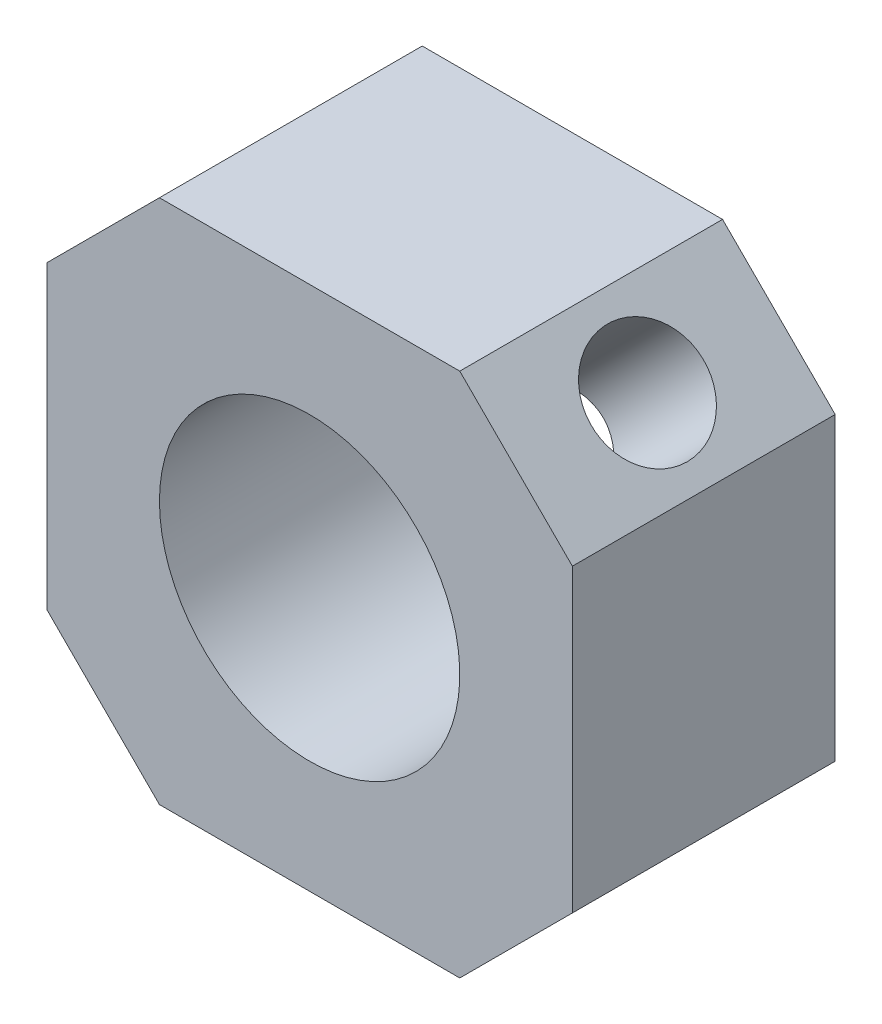
ISO-10303-21;
HEADER;
FILE_DESCRIPTION(('STEP AP214'),'2;1');
FILE_NAME('part.step','',(''),(''),'','','');
FILE_SCHEMA(('AUTOMOTIVE_DESIGN { 1 0 10303 214 1 1 1 1 }'));
ENDSEC;
DATA;
#1=APPLICATION_CONTEXT('core data for automotive mechanical design processes');
#2=APPLICATION_PROTOCOL_DEFINITION('international standard','automotive_design',2000,#1);
#3=PRODUCT_CONTEXT('',#1,'mechanical');
#4=PRODUCT('Part','Part','',(#3));
#5=PRODUCT_RELATED_PRODUCT_CATEGORY('part','',(#4));
#6=PRODUCT_DEFINITION_FORMATION('','',#4);
#7=PRODUCT_DEFINITION_CONTEXT('part definition',#1,'design');
#8=PRODUCT_DEFINITION('design','',#6,#7);
#9=PRODUCT_DEFINITION_SHAPE('','',#8);
#10=(LENGTH_UNIT() NAMED_UNIT(*) SI_UNIT(.MILLI.,.METRE.));
#11=(NAMED_UNIT(*) PLANE_ANGLE_UNIT() SI_UNIT($,.RADIAN.));
#12=(NAMED_UNIT(*) SI_UNIT($,.STERADIAN.) SOLID_ANGLE_UNIT());
#13=UNCERTAINTY_MEASURE_WITH_UNIT(LENGTH_MEASURE(1.E-05),#10,'distance_accuracy_value','');
#14=(GEOMETRIC_REPRESENTATION_CONTEXT(3) GLOBAL_UNCERTAINTY_ASSIGNED_CONTEXT((#13)) GLOBAL_UNIT_ASSIGNED_CONTEXT((#10,
#11,#12)) REPRESENTATION_CONTEXT('',''));
#15=CARTESIAN_POINT('',(0.,0.,0.));
#16=DIRECTION('',(0.,0.,1.));
#17=DIRECTION('',(1.,0.,0.));
#18=AXIS2_PLACEMENT_3D('',#15,#16,#17);
#19=CARTESIAN_POINT('',(5.578427125,5.578427125,-26.5));
#20=DIRECTION('',(-0.707106781186548,-0.707106781186548,0.));
#21=DIRECTION('',(0.707106781186548,-0.707106781186548,0.));
#22=AXIS2_PLACEMENT_3D('',#19,#20,#21);
#23=CYLINDRICAL_SURFACE('',#22,1.5);
#24=CARTESIAN_POINT('',(2.82842712237061,2.82842712237061,-28.));
#25=CARTESIAN_POINT('',(2.8858167510829,2.77103390829815,-27.9999967391737));
#26=CARTESIAN_POINT('',(2.94147140690556,2.71185431610224,-27.9933849725625));
#27=CARTESIAN_POINT('',(3.04775879295592,2.59183511030959,-27.9671921570462));
#28=CARTESIAN_POINT('',(3.09838741896399,2.5309941909401,-27.9476006075002));
#29=CARTESIAN_POINT('',(3.193472520482,2.40990637586566,-27.8962443985259));
#30=CARTESIAN_POINT('',(3.2379430145436,2.34965843098492,-27.8645080276378));
#31=CARTESIAN_POINT('',(3.32035897981574,2.23168142159578,-27.789886507077));
#32=CARTESIAN_POINT('',(3.35830379177576,2.17395261201963,-27.7470002320943));
#33=CARTESIAN_POINT('',(3.42890800250299,2.06087471249284,-27.6493879050116));
#34=CARTESIAN_POINT('',(3.46130879421228,2.00570187521155,-27.5942707615584));
#35=CARTESIAN_POINT('',(3.51916141549955,1.90237124953126,-27.474590779996));
#36=CARTESIAN_POINT('',(3.54461098918778,1.85421574083654,-27.4100248858842));
#37=CARTESIAN_POINT('',(3.58970301333526,1.76539300986052,-27.270282580811));
#38=CARTESIAN_POINT('',(3.6090874169981,1.72508078192346,-27.1947957420072));
#39=CARTESIAN_POINT('',(3.64102365960012,1.65661838685408,-27.0371517656455));
#40=CARTESIAN_POINT('',(3.65357821808974,1.62846337980608,-26.9549972980428));
#41=CARTESIAN_POINT('',(3.67174277929914,1.58707275190751,-26.7898832459272));
#42=CARTESIAN_POINT('',(3.67761653071947,1.57327249589394,-26.7070949337251));
#43=CARTESIAN_POINT('',(3.68344379858428,1.55958414241461,-26.5401838137721));
#44=CARTESIAN_POINT('',(3.68339976200063,1.55969029472724,-26.4560615719806));
#45=CARTESIAN_POINT('',(3.67757710355411,1.57336265127034,-26.2942306040685));
#46=CARTESIAN_POINT('',(3.6721418447921,1.58612291361214,-26.2164393507037));
#47=CARTESIAN_POINT('',(3.65594789858781,1.62309827210491,-26.0642130955572));
#48=CARTESIAN_POINT('',(3.64518839194722,1.64731513096311,-25.9897786121776));
#49=CARTESIAN_POINT('',(3.61790765642888,1.70640456732384,-25.8447212570608));
#50=CARTESIAN_POINT('',(3.60128115414046,1.74147028803811,-25.7741972861848));
#51=CARTESIAN_POINT('',(3.56205133162023,1.82036457474259,-25.6400513340722));
#52=CARTESIAN_POINT('',(3.5394462203318,1.86419576570913,-25.5764314292068));
#53=CARTESIAN_POINT('',(3.48625168968779,1.96197478270727,-25.453406123959));
#54=CARTESIAN_POINT('',(3.45522845918882,2.01640395340795,-25.3945695517068));
#55=CARTESIAN_POINT('',(3.38580095625726,2.13092246581182,-25.2876767763049));
#56=CARTESIAN_POINT('',(3.34739328980197,2.19101440372648,-25.2396255523964));
#57=CARTESIAN_POINT('',(3.26255032282609,2.31549718417046,-25.1550359414123));
#58=CARTESIAN_POINT('',(3.21599562697787,2.37994169954501,-25.1186955703888));
#59=CARTESIAN_POINT('',(3.1158581746412,2.50960096639428,-25.0599803795133));
#60=CARTESIAN_POINT('',(3.06228990890183,2.57481388415266,-25.0375772981992));
#61=CARTESIAN_POINT('',(2.97758897144,2.67129465820976,-25.0150813367619));
#62=CARTESIAN_POINT('',(2.94861065906056,2.7032518076581,-25.0094340760901));
#63=CARTESIAN_POINT('',(2.88940417240811,2.76644495908647,-25.0018921542245));
#64=CARTESIAN_POINT('',(2.85917600031453,2.79768096232383,-24.9999974864874));
#65=CARTESIAN_POINT('',(2.77106995852296,2.88577921641145,-25.0000046885598));
#66=CARTESIAN_POINT('',(2.71190099887313,2.94142690126263,-25.0066106185343));
#67=CARTESIAN_POINT('',(2.59187464677271,3.04772695087165,-25.0327934266968));
#68=CARTESIAN_POINT('',(2.53101481456976,3.09837155979683,-25.0523900916654));
#69=CARTESIAN_POINT('',(2.40990222112152,3.19347544820323,-25.103757916032));
#70=CARTESIAN_POINT('',(2.34964829697028,3.23795038455449,-25.1354974605386));
#71=CARTESIAN_POINT('',(2.2316711397234,3.32036587118705,-25.2101209188034));
#72=CARTESIAN_POINT('',(2.17394772594763,3.35830688856282,-25.2530040353837));
#73=CARTESIAN_POINT('',(2.06088012573435,3.42890457479472,-25.3506073705363));
#74=CARTESIAN_POINT('',(2.0057121234456,3.46130273321263,-25.4057185301381));
#75=CARTESIAN_POINT('',(1.90238010250571,3.51915678289752,-25.5253978046587));
#76=CARTESIAN_POINT('',(1.85421965944117,3.54460913584592,-25.5899707139175));
#77=CARTESIAN_POINT('',(1.76537276733117,3.58971314850251,-25.7297474334975));
#78=CARTESIAN_POINT('',(1.72504491697488,3.60910412670062,-25.8052645489215));
#79=CARTESIAN_POINT('',(1.65659243549965,3.64103578027797,-25.9629302558076));
#80=CARTESIAN_POINT('',(1.62845204380824,3.65358530835071,-26.0450701187374));
#81=CARTESIAN_POINT('',(1.59220704276558,3.66948804512987,-26.1896193196004));
#82=CARTESIAN_POINT('',(1.58068343303945,3.6744400635475,-26.2510167889239));
#83=CARTESIAN_POINT('',(1.56525956935763,3.68103697889983,-26.3749356430266));
#84=CARTESIAN_POINT('',(1.56135825224795,3.68268233704696,-26.4374568698368));
#85=CARTESIAN_POINT('',(1.56136672631741,3.68268222829612,-26.5809377847355));
#86=CARTESIAN_POINT('',(1.56791132446482,3.67992656578692,-26.6619122515553));
#87=CARTESIAN_POINT('',(1.59365720242449,3.66884777597601,-26.8214651905766));
#88=CARTESIAN_POINT('',(1.61286960824528,3.660519754432,-26.9000414929618));
#89=CARTESIAN_POINT('',(1.66266415614193,3.63817043574195,-27.0523797522388));
#90=CARTESIAN_POINT('',(1.69321485204496,3.62416487514072,-27.1261543673702));
#91=CARTESIAN_POINT('',(1.76403522521898,3.59022503630223,-27.2673843419523));
#92=CARTESIAN_POINT('',(1.80430612531289,3.57029001205212,-27.3348389048434));
#93=CARTESIAN_POINT('',(1.89473746021013,3.52316338111023,-27.4648843692848));
#94=CARTESIAN_POINT('',(1.94526260566188,3.49568452350118,-27.5271176582646));
#95=CARTESIAN_POINT('',(2.05279334298948,3.43364073382681,-27.6417138522786));
#96=CARTESIAN_POINT('',(2.10980142609716,3.39907307358399,-27.6940729422179));
#97=CARTESIAN_POINT('',(2.23012281064592,3.32142266912963,-27.7891603817045));
#98=CARTESIAN_POINT('',(2.29358552424344,3.27808797964994,-27.8314956199557));
#99=CARTESIAN_POINT('',(2.42248618522022,3.18400669593868,-27.9026773706419));
#100=CARTESIAN_POINT('',(2.48792163090703,3.13326919972803,-27.9315402602819));
#101=CARTESIAN_POINT('',(2.59986247345144,3.04046578185228,-27.9686225208461));
#102=CARTESIAN_POINT('',(2.64652619684261,2.99996294482793,-27.9803622279266));
#103=CARTESIAN_POINT('',(2.73861485572925,2.91613845193941,-27.9960518152964));
#104=CARTESIAN_POINT('',(2.78403992214842,2.87281709563915,-28.0000025220402));
#105=CARTESIAN_POINT('',(2.82842712237061,2.82842712237061,-28.));
#106=B_SPLINE_CURVE_WITH_KNOTS('',3,(#24,#25,#26,#27,#28,#29,#30,#31,#32,#33,#34,#35,#36,#37,
#38,#39,#40,#41,#42,#43,#44,#45,#46,#47,#48,#49,#50,#51,#52,#53,#54,#55,#56,#57,#58,#59,#60,#61,
#62,#63,#64,#65,#66,#67,#68,#69,#70,#71,#72,#73,#74,#75,#76,#77,#78,#79,#80,#81,#82,#83,#84,#85,
#86,#87,#88,#89,#90,#91,#92,#93,#94,#95,#96,#97,#98,#99,#100,#101,#102,#103,#104,#105),
.UNSPECIFIED.,.T.,.F.,(4,2,2,2,2,2,2,2,2,2,2,2,2,2,2,2,2,2,2,2,2,2,2,2,2,2,2,2,2,2,2,2,2,2,2,2,
2,2,2,2,4),(0.,0.243253763313617,0.486704559552642,0.729591711705768,0.972503386895082,
1.22473384183383,1.47704605652273,1.73896656346589,2.00078270078507,2.25185879353768,
2.50283106806612,2.73878307032546,2.97477138787563,3.21522959216142,3.45575991406646,
3.71242212344639,3.96920258273348,4.23012121854587,4.49050903488058,4.62086965089053,
4.75123003959512,4.99439670693859,5.23793460615235,5.48084270449046,5.72373343068615,
5.97594064538399,6.22827610016353,6.49031437465638,6.75201276737895,6.93948354183687,
7.12692816608689,7.36950241217557,7.61228999309366,7.85440918661563,8.09655885515098,
8.34965286487241,8.60284446309199,8.86474306204039,9.12632245831892,9.31448362227116,
9.50262482024151),.UNSPECIFIED.);
#107=CARTESIAN_POINT('',(2.82842712237061,2.82842712237061,-28.));
#108=VERTEX_POINT('',#107);
#109=EDGE_CURVE('E103',#108,#108,#106,.T.);
#110=ORIENTED_EDGE('',*,*,#109,.T.);
#111=EDGE_LOOP('',(#110));
#112=FACE_BOUND('',#111,.T.);
#113=CARTESIAN_POINT('',(5.5,5.5,-26.5));
#114=DIRECTION('',(-0.707106781186548,-0.707106781186548,0.));
#115=DIRECTION('',(0.707106781186548,-0.707106781186548,0.));
#116=AXIS2_PLACEMENT_3D('',#113,#114,#115);
#117=CIRCLE('',#116,1.5);
#118=CARTESIAN_POINT('',(6.56066017177982,4.43933982822018,-26.5));
#119=VERTEX_POINT('',#118);
#120=EDGE_CURVE('E115',#119,#119,#117,.T.);
#121=ORIENTED_EDGE('',*,*,#120,.F.);
#122=EDGE_LOOP('',(#121));
#123=FACE_BOUND('',#122,.T.);
#124=ADVANCED_FACE('F16',(#112,#123),#23,.F.);
#125=CARTESIAN_POINT('',(0.,0.,-23.));
#126=DIRECTION('',(0.,0.,1.));
#127=DIRECTION('',(1.,0.,0.));
#128=AXIS2_PLACEMENT_3D('',#125,#126,#127);
#129=PLANE('',#128);
#130=DIRECTION('',(1.,0.,0.));
#131=VECTOR('',#130,1.);
#132=CARTESIAN_POINT('',(0.,-7.,-23.));
#133=LINE('',#132,#131);
#134=CARTESIAN_POINT('',(4.,-7.,-23.));
#135=VERTEX_POINT('',#134);
#136=CARTESIAN_POINT('',(-4.,-7.,-23.));
#137=VERTEX_POINT('',#136);
#138=EDGE_CURVE('E578',#135,#137,#133,.F.);
#139=ORIENTED_EDGE('',*,*,#138,.F.);
#140=DIRECTION('',(0.707106781186548,0.707106781186548,0.));
#141=VECTOR('',#140,1.);
#142=CARTESIAN_POINT('',(5.5,-5.5,-23.));
#143=LINE('',#142,#141);
#144=CARTESIAN_POINT('',(7.,-4.,-23.));
#145=VERTEX_POINT('',#144);
#146=EDGE_CURVE('E598',#145,#135,#143,.F.);
#147=ORIENTED_EDGE('',*,*,#146,.F.);
#148=DIRECTION('',(0.,1.,0.));
#149=VECTOR('',#148,1.);
#150=CARTESIAN_POINT('',(7.,0.,-23.));
#151=LINE('',#150,#149);
#152=CARTESIAN_POINT('',(7.,4.,-23.));
#153=VERTEX_POINT('',#152);
#154=EDGE_CURVE('E594',#153,#145,#151,.F.);
#155=ORIENTED_EDGE('',*,*,#154,.F.);
#156=DIRECTION('',(-0.707106781186548,0.707106781186548,0.));
#157=VECTOR('',#156,1.);
#158=CARTESIAN_POINT('',(5.5,5.5,-23.));
#159=LINE('',#158,#157);
#160=CARTESIAN_POINT('',(4.,7.,-23.));
#161=VERTEX_POINT('',#160);
#162=EDGE_CURVE('E99',#161,#153,#159,.F.);
#163=ORIENTED_EDGE('',*,*,#162,.F.);
#164=DIRECTION('',(1.,0.,0.));
#165=VECTOR('',#164,1.);
#166=CARTESIAN_POINT('',(0.,7.,-23.));
#167=LINE('',#166,#165);
#168=CARTESIAN_POINT('',(-4.,7.,-23.));
#169=VERTEX_POINT('',#168);
#170=EDGE_CURVE('E92',#169,#161,#167,.T.);
#171=ORIENTED_EDGE('',*,*,#170,.F.);
#172=DIRECTION('',(-0.707106781186548,-0.707106781186548,0.));
#173=VECTOR('',#172,1.);
#174=CARTESIAN_POINT('',(-5.5,5.5,-23.));
#175=LINE('',#174,#173);
#176=CARTESIAN_POINT('',(-7.,4.,-23.));
#177=VERTEX_POINT('',#176);
#178=EDGE_CURVE('E83',#177,#169,#175,.F.);
#179=ORIENTED_EDGE('',*,*,#178,.F.);
#180=DIRECTION('',(0.,1.,0.));
#181=VECTOR('',#180,1.);
#182=CARTESIAN_POINT('',(-7.,0.,-23.));
#183=LINE('',#182,#181);
#184=CARTESIAN_POINT('',(-7.,-4.,-23.));
#185=VERTEX_POINT('',#184);
#186=EDGE_CURVE('E78',#185,#177,#183,.T.);
#187=ORIENTED_EDGE('',*,*,#186,.F.);
#188=DIRECTION('',(0.707106781186548,-0.707106781186548,0.));
#189=VECTOR('',#188,1.);
#190=CARTESIAN_POINT('',(-5.5,-5.5,-23.));
#191=LINE('',#190,#189);
#192=EDGE_CURVE('E569',#137,#185,#191,.F.);
#193=ORIENTED_EDGE('',*,*,#192,.F.);
#194=EDGE_LOOP('',(#139,#147,#155,#163,#171,#179,#187,#193));
#195=FACE_BOUND('',#194,.T.);
#196=CARTESIAN_POINT('',(0.,0.,-23.));
#197=DIRECTION('',(0.,0.,-1.));
#198=DIRECTION('',(-1.,0.,0.));
#199=AXIS2_PLACEMENT_3D('',#196,#197,#198);
#200=CIRCLE('',#199,3.99999999664043);
#201=CARTESIAN_POINT('',(-3.99999999664043,0.,-23.));
#202=VERTEX_POINT('',#201);
#203=EDGE_CURVE('E20',#202,#202,#200,.T.);
#204=ORIENTED_EDGE('',*,*,#203,.T.);
#205=EDGE_LOOP('',(#204));
#206=FACE_BOUND('',#205,.T.);
#207=ADVANCED_FACE('F96',(#195,#206),#129,.T.);
#208=CARTESIAN_POINT('',(0.,0.,-23.));
#209=DIRECTION('',(0.,0.,-1.));
#210=DIRECTION('',(-1.,0.,0.));
#211=AXIS2_PLACEMENT_3D('',#208,#209,#210);
#212=CYLINDRICAL_SURFACE('',#211,3.99999999664043);
#213=CARTESIAN_POINT('',(0.,0.,-30.));
#214=DIRECTION('',(0.,0.,-1.));
#215=DIRECTION('',(-1.,0.,0.));
#216=AXIS2_PLACEMENT_3D('',#213,#214,#215);
#217=CIRCLE('',#216,3.99999999664043);
#218=CARTESIAN_POINT('',(-3.99999999664043,0.,-30.));
#219=VERTEX_POINT('',#218);
#220=EDGE_CURVE('E112',#219,#219,#217,.T.);
#221=ORIENTED_EDGE('',*,*,#220,.T.);
#222=EDGE_LOOP('',(#221));
#223=FACE_BOUND('',#222,.T.);
#224=ORIENTED_EDGE('',*,*,#109,.F.);
#225=EDGE_LOOP('',(#224));
#226=FACE_BOUND('',#225,.T.);
#227=ORIENTED_EDGE('',*,*,#203,.F.);
#228=EDGE_LOOP('',(#227));
#229=FACE_BOUND('',#228,.T.);
#230=ADVANCED_FACE('F124',(#223,#226,#229),#212,.F.);
#231=CARTESIAN_POINT('',(0.,7.,-23.));
#232=DIRECTION('',(0.,1.,0.));
#233=DIRECTION('',(0.,0.,1.));
#234=AXIS2_PLACEMENT_3D('',#231,#232,#233);
#235=PLANE('',#234);
#236=ORIENTED_EDGE('',*,*,#170,.T.);
#237=DIRECTION('',(0.,0.,1.));
#238=VECTOR('',#237,1.);
#239=CARTESIAN_POINT('',(4.,7.,-23.));
#240=LINE('',#239,#238);
#241=CARTESIAN_POINT('',(4.,7.,-30.));
#242=VERTEX_POINT('',#241);
#243=EDGE_CURVE('E117',#242,#161,#240,.T.);
#244=ORIENTED_EDGE('',*,*,#243,.F.);
#245=DIRECTION('',(1.,0.,0.));
#246=VECTOR('',#245,1.);
#247=CARTESIAN_POINT('',(0.,7.,-30.));
#248=LINE('',#247,#246);
#249=CARTESIAN_POINT('',(-4.,7.,-30.));
#250=VERTEX_POINT('',#249);
#251=EDGE_CURVE('E107',#242,#250,#248,.F.);
#252=ORIENTED_EDGE('',*,*,#251,.T.);
#253=DIRECTION('',(0.,0.,1.));
#254=VECTOR('',#253,1.);
#255=CARTESIAN_POINT('',(-4.,7.,-23.));
#256=LINE('',#255,#254);
#257=EDGE_CURVE('E88',#169,#250,#256,.F.);
#258=ORIENTED_EDGE('',*,*,#257,.F.);
#259=EDGE_LOOP('',(#236,#244,#252,#258));
#260=FACE_BOUND('',#259,.T.);
#261=ADVANCED_FACE('F106',(#260),#235,.T.);
#262=CARTESIAN_POINT('',(-5.5,5.5,-23.));
#263=DIRECTION('',(-0.707106781186548,0.707106781186548,0.));
#264=DIRECTION('',(-0.707106781186548,-0.707106781186548,0.));
#265=AXIS2_PLACEMENT_3D('',#262,#263,#264);
#266=PLANE('',#265);
#267=ORIENTED_EDGE('',*,*,#178,.T.);
#268=ORIENTED_EDGE('',*,*,#257,.T.);
#269=DIRECTION('',(-0.707106781186548,-0.707106781186548,0.));
#270=VECTOR('',#269,1.);
#271=CARTESIAN_POINT('',(-4.,7.,-30.));
#272=LINE('',#271,#270);
#273=CARTESIAN_POINT('',(-7.,4.,-30.));
#274=VERTEX_POINT('',#273);
#275=EDGE_CURVE('E582',#250,#274,#272,.T.);
#276=ORIENTED_EDGE('',*,*,#275,.T.);
#277=DIRECTION('',(0.,0.,1.));
#278=VECTOR('',#277,1.);
#279=CARTESIAN_POINT('',(-7.,4.,-23.));
#280=LINE('',#279,#278);
#281=EDGE_CURVE('E90',#177,#274,#280,.F.);
#282=ORIENTED_EDGE('',*,*,#281,.F.);
#283=EDGE_LOOP('',(#267,#268,#276,#282));
#284=FACE_BOUND('',#283,.T.);
#285=ADVANCED_FACE('F85',(#284),#266,.T.);
#286=CARTESIAN_POINT('',(-7.,0.,-23.));
#287=DIRECTION('',(-1.,0.,0.));
#288=DIRECTION('',(0.,0.,1.));
#289=AXIS2_PLACEMENT_3D('',#286,#287,#288);
#290=PLANE('',#289);
#291=ORIENTED_EDGE('',*,*,#186,.T.);
#292=ORIENTED_EDGE('',*,*,#281,.T.);
#293=DIRECTION('',(0.,1.,0.));
#294=VECTOR('',#293,1.);
#295=CARTESIAN_POINT('',(-7.,0.,-30.));
#296=LINE('',#295,#294);
#297=CARTESIAN_POINT('',(-7.,-4.,-30.));
#298=VERTEX_POINT('',#297);
#299=EDGE_CURVE('E577',#274,#298,#296,.F.);
#300=ORIENTED_EDGE('',*,*,#299,.T.);
#301=DIRECTION('',(0.,0.,1.));
#302=VECTOR('',#301,1.);
#303=CARTESIAN_POINT('',(-7.,-4.,-23.));
#304=LINE('',#303,#302);
#305=EDGE_CURVE('E571',#185,#298,#304,.F.);
#306=ORIENTED_EDGE('',*,*,#305,.F.);
#307=EDGE_LOOP('',(#291,#292,#300,#306));
#308=FACE_BOUND('',#307,.T.);
#309=ADVANCED_FACE('F165',(#308),#290,.T.);
#310=CARTESIAN_POINT('',(-5.5,-5.5,-23.));
#311=DIRECTION('',(-0.707106781186548,-0.707106781186548,0.));
#312=DIRECTION('',(0.707106781186548,-0.707106781186548,0.));
#313=AXIS2_PLACEMENT_3D('',#310,#311,#312);
#314=PLANE('',#313);
#315=ORIENTED_EDGE('',*,*,#192,.T.);
#316=ORIENTED_EDGE('',*,*,#305,.T.);
#317=DIRECTION('',(0.707106781186548,-0.707106781186548,0.));
#318=VECTOR('',#317,1.);
#319=CARTESIAN_POINT('',(-7.,-4.,-30.));
#320=LINE('',#319,#318);
#321=CARTESIAN_POINT('',(-4.,-7.,-30.));
#322=VERTEX_POINT('',#321);
#323=EDGE_CURVE('E584',#298,#322,#320,.T.);
#324=ORIENTED_EDGE('',*,*,#323,.T.);
#325=DIRECTION('',(0.,0.,-1.));
#326=VECTOR('',#325,1.);
#327=CARTESIAN_POINT('',(-4.,-7.,-23.));
#328=LINE('',#327,#326);
#329=EDGE_CURVE('E573',#137,#322,#328,.T.);
#330=ORIENTED_EDGE('',*,*,#329,.F.);
#331=EDGE_LOOP('',(#315,#316,#324,#330));
#332=FACE_BOUND('',#331,.T.);
#333=ADVANCED_FACE('F161',(#332),#314,.T.);
#334=CARTESIAN_POINT('',(0.,-7.,-23.));
#335=DIRECTION('',(0.,-1.,0.));
#336=DIRECTION('',(0.,0.,-1.));
#337=AXIS2_PLACEMENT_3D('',#334,#335,#336);
#338=PLANE('',#337);
#339=ORIENTED_EDGE('',*,*,#138,.T.);
#340=ORIENTED_EDGE('',*,*,#329,.T.);
#341=DIRECTION('',(1.,0.,0.));
#342=VECTOR('',#341,1.);
#343=CARTESIAN_POINT('',(0.,-7.,-30.));
#344=LINE('',#343,#342);
#345=CARTESIAN_POINT('',(4.,-7.,-30.));
#346=VERTEX_POINT('',#345);
#347=EDGE_CURVE('E601',#322,#346,#344,.T.);
#348=ORIENTED_EDGE('',*,*,#347,.T.);
#349=DIRECTION('',(0.,0.,1.));
#350=VECTOR('',#349,1.);
#351=CARTESIAN_POINT('',(4.,-7.,-23.));
#352=LINE('',#351,#350);
#353=EDGE_CURVE('E596',#135,#346,#352,.F.);
#354=ORIENTED_EDGE('',*,*,#353,.F.);
#355=EDGE_LOOP('',(#339,#340,#348,#354));
#356=FACE_BOUND('',#355,.T.);
#357=ADVANCED_FACE('F157',(#356),#338,.T.);
#358=CARTESIAN_POINT('',(5.5,-5.5,-23.));
#359=DIRECTION('',(0.707106781186548,-0.707106781186548,0.));
#360=DIRECTION('',(0.707106781186548,0.707106781186548,0.));
#361=AXIS2_PLACEMENT_3D('',#358,#359,#360);
#362=PLANE('',#361);
#363=ORIENTED_EDGE('',*,*,#146,.T.);
#364=ORIENTED_EDGE('',*,*,#353,.T.);
#365=DIRECTION('',(0.707106781186548,0.707106781186548,0.));
#366=VECTOR('',#365,1.);
#367=CARTESIAN_POINT('',(4.,-7.,-30.));
#368=LINE('',#367,#366);
#369=CARTESIAN_POINT('',(7.,-4.,-30.));
#370=VERTEX_POINT('',#369);
#371=EDGE_CURVE('E604',#346,#370,#368,.T.);
#372=ORIENTED_EDGE('',*,*,#371,.T.);
#373=DIRECTION('',(0.,0.,-1.));
#374=VECTOR('',#373,1.);
#375=CARTESIAN_POINT('',(7.,-4.,-23.));
#376=LINE('',#375,#374);
#377=EDGE_CURVE('E118',#145,#370,#376,.T.);
#378=ORIENTED_EDGE('',*,*,#377,.F.);
#379=EDGE_LOOP('',(#363,#364,#372,#378));
#380=FACE_BOUND('',#379,.T.);
#381=ADVANCED_FACE('F153',(#380),#362,.T.);
#382=CARTESIAN_POINT('',(7.,0.,-23.));
#383=DIRECTION('',(1.,0.,0.));
#384=DIRECTION('',(0.,0.,-1.));
#385=AXIS2_PLACEMENT_3D('',#382,#383,#384);
#386=PLANE('',#385);
#387=ORIENTED_EDGE('',*,*,#154,.T.);
#388=ORIENTED_EDGE('',*,*,#377,.T.);
#389=DIRECTION('',(0.,1.,0.));
#390=VECTOR('',#389,1.);
#391=CARTESIAN_POINT('',(7.,0.,-30.));
#392=LINE('',#391,#390);
#393=CARTESIAN_POINT('',(7.,4.,-30.));
#394=VERTEX_POINT('',#393);
#395=EDGE_CURVE('E26',#370,#394,#392,.T.);
#396=ORIENTED_EDGE('',*,*,#395,.T.);
#397=DIRECTION('',(0.,0.,1.));
#398=VECTOR('',#397,1.);
#399=CARTESIAN_POINT('',(7.,4.,-23.));
#400=LINE('',#399,#398);
#401=EDGE_CURVE('E34',#153,#394,#400,.F.);
#402=ORIENTED_EDGE('',*,*,#401,.F.);
#403=EDGE_LOOP('',(#387,#388,#396,#402));
#404=FACE_BOUND('',#403,.T.);
#405=ADVANCED_FACE('F146',(#404),#386,.T.);
#406=CARTESIAN_POINT('',(5.5,5.5,-23.));
#407=DIRECTION('',(0.707106781186548,0.707106781186548,0.));
#408=DIRECTION('',(-0.707106781186548,0.707106781186548,0.));
#409=AXIS2_PLACEMENT_3D('',#406,#407,#408);
#410=PLANE('',#409);
#411=ORIENTED_EDGE('',*,*,#162,.T.);
#412=ORIENTED_EDGE('',*,*,#401,.T.);
#413=DIRECTION('',(-0.707106781186548,0.707106781186548,0.));
#414=VECTOR('',#413,1.);
#415=CARTESIAN_POINT('',(7.,4.,-30.));
#416=LINE('',#415,#414);
#417=EDGE_CURVE('E11',#394,#242,#416,.T.);
#418=ORIENTED_EDGE('',*,*,#417,.T.);
#419=ORIENTED_EDGE('',*,*,#243,.T.);
#420=EDGE_LOOP('',(#411,#412,#418,#419));
#421=FACE_BOUND('',#420,.T.);
#422=ORIENTED_EDGE('',*,*,#120,.T.);
#423=EDGE_LOOP('',(#422));
#424=FACE_BOUND('',#423,.T.);
#425=ADVANCED_FACE('F139',(#421,#424),#410,.T.);
#426=CARTESIAN_POINT('',(0.,0.,-30.));
#427=DIRECTION('',(0.,0.,1.));
#428=DIRECTION('',(1.,0.,0.));
#429=AXIS2_PLACEMENT_3D('',#426,#427,#428);
#430=PLANE('',#429);
#431=ORIENTED_EDGE('',*,*,#395,.F.);
#432=ORIENTED_EDGE('',*,*,#371,.F.);
#433=ORIENTED_EDGE('',*,*,#347,.F.);
#434=ORIENTED_EDGE('',*,*,#323,.F.);
#435=ORIENTED_EDGE('',*,*,#299,.F.);
#436=ORIENTED_EDGE('',*,*,#275,.F.);
#437=ORIENTED_EDGE('',*,*,#251,.F.);
#438=ORIENTED_EDGE('',*,*,#417,.F.);
#439=EDGE_LOOP('',(#431,#432,#433,#434,#435,#436,#437,#438));
#440=FACE_BOUND('',#439,.T.);
#441=ORIENTED_EDGE('',*,*,#220,.F.);
#442=EDGE_LOOP('',(#441));
#443=FACE_BOUND('',#442,.T.);
#444=ADVANCED_FACE('F137',(#440,#443),#430,.F.);
#445=CLOSED_SHELL('',(#124,#207,#230,#261,#285,#309,#333,#357,#381,#405,#425,#444));
#446=MANIFOLD_SOLID_BREP('B1',#445);
#447=ADVANCED_BREP_SHAPE_REPRESENTATION('',(#18,#446),#14);
#448=SHAPE_DEFINITION_REPRESENTATION(#9,#447);
ENDSEC;
END-ISO-10303-21;
